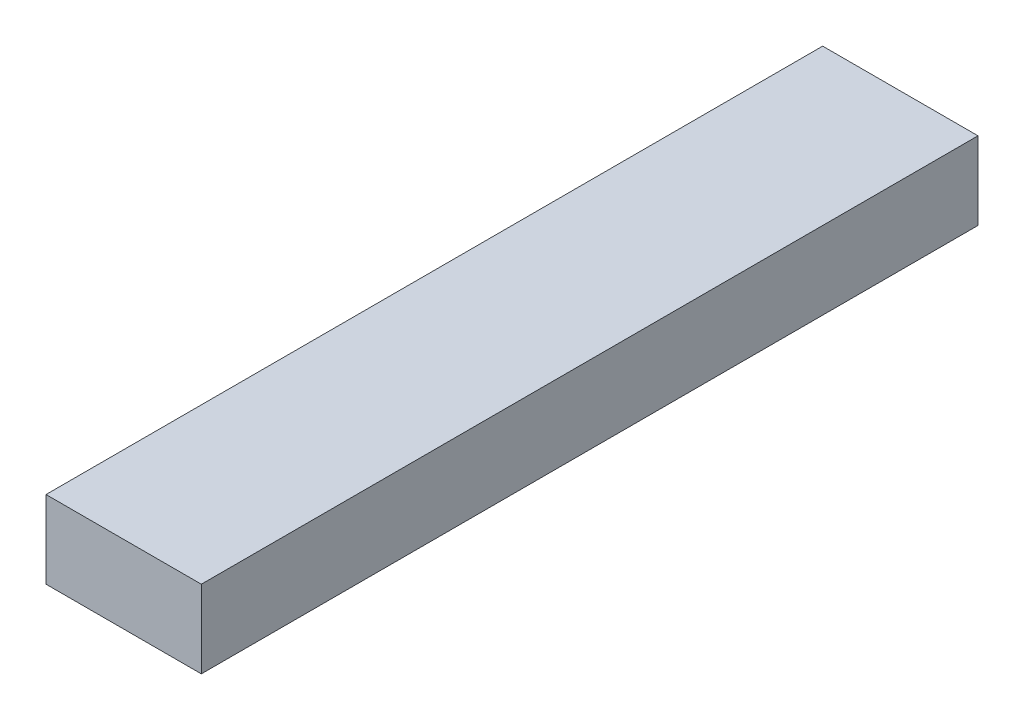
ISO-10303-21;
HEADER;
FILE_DESCRIPTION(('STEP AP214'),'2;1');
FILE_NAME('part.step','',(''),(''),'','','');
FILE_SCHEMA(('AUTOMOTIVE_DESIGN { 1 0 10303 214 1 1 1 1 }'));
ENDSEC;
DATA;
#1=APPLICATION_CONTEXT('core data for automotive mechanical design processes');
#2=APPLICATION_PROTOCOL_DEFINITION('international standard','automotive_design',2000,#1);
#3=PRODUCT_CONTEXT('',#1,'mechanical');
#4=PRODUCT('Part','Part','',(#3));
#5=PRODUCT_RELATED_PRODUCT_CATEGORY('part','',(#4));
#6=PRODUCT_DEFINITION_FORMATION('','',#4);
#7=PRODUCT_DEFINITION_CONTEXT('part definition',#1,'design');
#8=PRODUCT_DEFINITION('design','',#6,#7);
#9=PRODUCT_DEFINITION_SHAPE('','',#8);
#10=(LENGTH_UNIT() NAMED_UNIT(*) SI_UNIT(.MILLI.,.METRE.));
#11=(NAMED_UNIT(*) PLANE_ANGLE_UNIT() SI_UNIT($,.RADIAN.));
#12=(NAMED_UNIT(*) SI_UNIT($,.STERADIAN.) SOLID_ANGLE_UNIT());
#13=UNCERTAINTY_MEASURE_WITH_UNIT(LENGTH_MEASURE(1.E-05),#10,'distance_accuracy_value','');
#14=(GEOMETRIC_REPRESENTATION_CONTEXT(3) GLOBAL_UNCERTAINTY_ASSIGNED_CONTEXT((#13)) GLOBAL_UNIT_ASSIGNED_CONTEXT((#10,
#11,#12)) REPRESENTATION_CONTEXT('',''));
#15=CARTESIAN_POINT('',(0.,0.,0.));
#16=DIRECTION('',(0.,0.,1.));
#17=DIRECTION('',(1.,0.,0.));
#18=AXIS2_PLACEMENT_3D('',#15,#16,#17);
#19=CARTESIAN_POINT('',(-10.0000000000001,10.,-50.));
#20=DIRECTION('',(1.,0.,0.));
#21=DIRECTION('',(0.,0.,-1.));
#22=AXIS2_PLACEMENT_3D('',#19,#20,#21);
#23=PLANE('',#22);
#24=DIRECTION('',(0.,0.,1.));
#25=VECTOR('',#24,1.);
#26=CARTESIAN_POINT('',(-10.0000000000001,0.,-50.));
#27=LINE('',#26,#25);
#28=CARTESIAN_POINT('',(-10.0000000000001,0.,-50.));
#29=VERTEX_POINT('',#28);
#30=CARTESIAN_POINT('',(-10.,0.,50.));
#31=VERTEX_POINT('',#30);
#32=EDGE_CURVE('E96',#29,#31,#27,.T.);
#33=ORIENTED_EDGE('',*,*,#32,.T.);
#34=DIRECTION('',(0.,-1.,0.));
#35=VECTOR('',#34,1.);
#36=CARTESIAN_POINT('',(-10.,10.,50.));
#37=LINE('',#36,#35);
#38=CARTESIAN_POINT('',(-10.,10.,50.));
#39=VERTEX_POINT('',#38);
#40=EDGE_CURVE('E11',#39,#31,#37,.T.);
#41=ORIENTED_EDGE('',*,*,#40,.F.);
#42=DIRECTION('',(0.,0.,1.));
#43=VECTOR('',#42,1.);
#44=CARTESIAN_POINT('',(-10.0000000000001,10.,-50.));
#45=LINE('',#44,#43);
#46=CARTESIAN_POINT('',(-10.0000000000001,10.,-50.));
#47=VERTEX_POINT('',#46);
#48=EDGE_CURVE('E84',#47,#39,#45,.T.);
#49=ORIENTED_EDGE('',*,*,#48,.F.);
#50=DIRECTION('',(0.,-1.,0.));
#51=VECTOR('',#50,1.);
#52=CARTESIAN_POINT('',(-10.0000000000001,10.,-50.));
#53=LINE('',#52,#51);
#54=EDGE_CURVE('E92',#47,#29,#53,.T.);
#55=ORIENTED_EDGE('',*,*,#54,.T.);
#56=EDGE_LOOP('',(#33,#41,#49,#55));
#57=FACE_BOUND('',#56,.T.);
#58=ADVANCED_FACE('F33',(#57),#23,.F.);
#59=CARTESIAN_POINT('',(-10.,10.,50.));
#60=DIRECTION('',(0.,0.,-1.));
#61=DIRECTION('',(-1.,0.,0.));
#62=AXIS2_PLACEMENT_3D('',#59,#60,#61);
#63=PLANE('',#62);
#64=DIRECTION('',(1.,0.,0.));
#65=VECTOR('',#64,1.);
#66=CARTESIAN_POINT('',(-10.,0.,50.));
#67=LINE('',#66,#65);
#68=CARTESIAN_POINT('',(10.,0.,50.));
#69=VERTEX_POINT('',#68);
#70=EDGE_CURVE('E88',#31,#69,#67,.T.);
#71=ORIENTED_EDGE('',*,*,#70,.T.);
#72=DIRECTION('',(0.,-1.,0.));
#73=VECTOR('',#72,1.);
#74=CARTESIAN_POINT('',(10.,10.,50.));
#75=LINE('',#74,#73);
#76=CARTESIAN_POINT('',(10.,10.,50.));
#77=VERTEX_POINT('',#76);
#78=EDGE_CURVE('E41',#77,#69,#75,.T.);
#79=ORIENTED_EDGE('',*,*,#78,.F.);
#80=DIRECTION('',(1.,0.,0.));
#81=VECTOR('',#80,1.);
#82=CARTESIAN_POINT('',(-10.,10.,50.));
#83=LINE('',#82,#81);
#84=EDGE_CURVE('E79',#39,#77,#83,.T.);
#85=ORIENTED_EDGE('',*,*,#84,.F.);
#86=ORIENTED_EDGE('',*,*,#40,.T.);
#87=EDGE_LOOP('',(#71,#79,#85,#86));
#88=FACE_BOUND('',#87,.T.);
#89=ADVANCED_FACE('F87',(#88),#63,.F.);
#90=CARTESIAN_POINT('',(9.99999999999995,10.,-50.));
#91=DIRECTION('',(-1.,0.,0.));
#92=DIRECTION('',(0.,0.,1.));
#93=AXIS2_PLACEMENT_3D('',#90,#91,#92);
#94=PLANE('',#93);
#95=DIRECTION('',(0.,0.,-1.));
#96=VECTOR('',#95,1.);
#97=CARTESIAN_POINT('',(9.99999999999995,0.,-50.));
#98=LINE('',#97,#96);
#99=CARTESIAN_POINT('',(9.99999999999995,0.,-50.));
#100=VERTEX_POINT('',#99);
#101=EDGE_CURVE('E66',#69,#100,#98,.T.);
#102=ORIENTED_EDGE('',*,*,#101,.T.);
#103=DIRECTION('',(0.,-1.,0.));
#104=VECTOR('',#103,1.);
#105=CARTESIAN_POINT('',(9.99999999999995,10.,-50.));
#106=LINE('',#105,#104);
#107=CARTESIAN_POINT('',(9.99999999999995,10.,-50.));
#108=VERTEX_POINT('',#107);
#109=EDGE_CURVE('E89',#108,#100,#106,.T.);
#110=ORIENTED_EDGE('',*,*,#109,.F.);
#111=DIRECTION('',(0.,0.,-1.));
#112=VECTOR('',#111,1.);
#113=CARTESIAN_POINT('',(9.99999999999995,10.,-50.));
#114=LINE('',#113,#112);
#115=EDGE_CURVE('E82',#77,#108,#114,.T.);
#116=ORIENTED_EDGE('',*,*,#115,.F.);
#117=ORIENTED_EDGE('',*,*,#78,.T.);
#118=EDGE_LOOP('',(#102,#110,#116,#117));
#119=FACE_BOUND('',#118,.T.);
#120=ADVANCED_FACE('F90',(#119),#94,.F.);
#121=CARTESIAN_POINT('',(-10.0000000000001,10.,-50.));
#122=DIRECTION('',(0.,0.,1.));
#123=DIRECTION('',(1.,0.,0.));
#124=AXIS2_PLACEMENT_3D('',#121,#122,#123);
#125=PLANE('',#124);
#126=DIRECTION('',(-1.,0.,0.));
#127=VECTOR('',#126,1.);
#128=CARTESIAN_POINT('',(-10.0000000000001,0.,-50.));
#129=LINE('',#128,#127);
#130=EDGE_CURVE('E72',#100,#29,#129,.T.);
#131=ORIENTED_EDGE('',*,*,#130,.T.);
#132=ORIENTED_EDGE('',*,*,#54,.F.);
#133=DIRECTION('',(-1.,0.,0.));
#134=VECTOR('',#133,1.);
#135=CARTESIAN_POINT('',(-10.0000000000001,10.,-50.));
#136=LINE('',#135,#134);
#137=EDGE_CURVE('E49',#108,#47,#136,.T.);
#138=ORIENTED_EDGE('',*,*,#137,.F.);
#139=ORIENTED_EDGE('',*,*,#109,.T.);
#140=EDGE_LOOP('',(#131,#132,#138,#139));
#141=FACE_BOUND('',#140,.T.);
#142=ADVANCED_FACE('F103',(#141),#125,.F.);
#143=CARTESIAN_POINT('',(0.,10.,0.));
#144=DIRECTION('',(0.,1.,0.));
#145=DIRECTION('',(0.,0.,1.));
#146=AXIS2_PLACEMENT_3D('',#143,#144,#145);
#147=PLANE('',#146);
#148=ORIENTED_EDGE('',*,*,#48,.T.);
#149=ORIENTED_EDGE('',*,*,#84,.T.);
#150=ORIENTED_EDGE('',*,*,#115,.T.);
#151=ORIENTED_EDGE('',*,*,#137,.T.);
#152=EDGE_LOOP('',(#148,#149,#150,#151));
#153=FACE_BOUND('',#152,.T.);
#154=ADVANCED_FACE('F80',(#153),#147,.T.);
#155=CARTESIAN_POINT('',(0.,0.,0.));
#156=DIRECTION('',(0.,1.,0.));
#157=DIRECTION('',(0.,0.,1.));
#158=AXIS2_PLACEMENT_3D('',#155,#156,#157);
#159=PLANE('',#158);
#160=ORIENTED_EDGE('',*,*,#32,.F.);
#161=ORIENTED_EDGE('',*,*,#130,.F.);
#162=ORIENTED_EDGE('',*,*,#101,.F.);
#163=ORIENTED_EDGE('',*,*,#70,.F.);
#164=EDGE_LOOP('',(#160,#161,#162,#163));
#165=FACE_BOUND('',#164,.T.);
#166=ADVANCED_FACE('F106',(#165),#159,.F.);
#167=CLOSED_SHELL('',(#58,#89,#120,#142,#154,#166));
#168=MANIFOLD_SOLID_BREP('B2',#167);
#169=ADVANCED_BREP_SHAPE_REPRESENTATION('',(#18,#168),#14);
#170=SHAPE_DEFINITION_REPRESENTATION(#9,#169);
ENDSEC;
END-ISO-10303-21;
